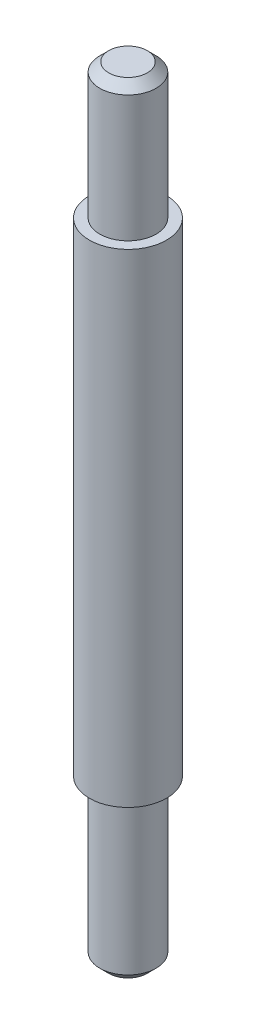
ISO-10303-21;
HEADER;
FILE_DESCRIPTION(('STEP AP214'),'2;1');
FILE_NAME('part.step','',(''),(''),'','','');
FILE_SCHEMA(('AUTOMOTIVE_DESIGN { 1 0 10303 214 1 1 1 1 }'));
ENDSEC;
DATA;
#1=APPLICATION_CONTEXT('core data for automotive mechanical design processes');
#2=APPLICATION_PROTOCOL_DEFINITION('international standard','automotive_design',2000,#1);
#3=PRODUCT_CONTEXT('',#1,'mechanical');
#4=PRODUCT('Part','Part','',(#3));
#5=PRODUCT_RELATED_PRODUCT_CATEGORY('part','',(#4));
#6=PRODUCT_DEFINITION_FORMATION('','',#4);
#7=PRODUCT_DEFINITION_CONTEXT('part definition',#1,'design');
#8=PRODUCT_DEFINITION('design','',#6,#7);
#9=PRODUCT_DEFINITION_SHAPE('','',#8);
#10=(LENGTH_UNIT() NAMED_UNIT(*) SI_UNIT(.MILLI.,.METRE.));
#11=(NAMED_UNIT(*) PLANE_ANGLE_UNIT() SI_UNIT($,.RADIAN.));
#12=(NAMED_UNIT(*) SI_UNIT($,.STERADIAN.) SOLID_ANGLE_UNIT());
#13=UNCERTAINTY_MEASURE_WITH_UNIT(LENGTH_MEASURE(1.E-05),#10,'distance_accuracy_value','');
#14=(GEOMETRIC_REPRESENTATION_CONTEXT(3) GLOBAL_UNCERTAINTY_ASSIGNED_CONTEXT((#13)) GLOBAL_UNIT_ASSIGNED_CONTEXT((#10,
#11,#12)) REPRESENTATION_CONTEXT('',''));
#15=CARTESIAN_POINT('',(0.,0.,0.));
#16=DIRECTION('',(0.,0.,1.));
#17=DIRECTION('',(1.,0.,0.));
#18=AXIS2_PLACEMENT_3D('',#15,#16,#17);
#19=CARTESIAN_POINT('',(0.,127.107886557542,0.));
#20=DIRECTION('',(0.,-1.,0.));
#21=DIRECTION('',(0.,0.,-1.));
#22=AXIS2_PLACEMENT_3D('',#19,#20,#21);
#23=PLANE('',#22);
#24=CARTESIAN_POINT('',(0.,127.107886557542,0.));
#25=DIRECTION('',(0.,1.,0.));
#26=DIRECTION('',(0.,0.,1.));
#27=AXIS2_PLACEMENT_3D('',#24,#25,#26);
#28=CIRCLE('',#27,6.5);
#29=CARTESIAN_POINT('',(0.,127.107886557542,6.5));
#30=VERTEX_POINT('',#29);
#31=EDGE_CURVE('E10',#30,#30,#28,.T.);
#32=ORIENTED_EDGE('',*,*,#31,.T.);
#33=EDGE_LOOP('',(#32));
#34=FACE_BOUND('',#33,.T.);
#35=ADVANCED_FACE('F39',(#34),#23,.F.);
#36=CARTESIAN_POINT('',(0.,124.107886557542,0.));
#37=DIRECTION('',(0.,-1.,0.));
#38=DIRECTION('',(0.,0.,-1.));
#39=AXIS2_PLACEMENT_3D('',#36,#37,#38);
#40=CONICAL_SURFACE('',#39,9.5,0.78539816339745);
#41=ORIENTED_EDGE('',*,*,#31,.F.);
#42=EDGE_LOOP('',(#41));
#43=FACE_BOUND('',#42,.T.);
#44=CARTESIAN_POINT('',(0.,124.107886557542,0.));
#45=DIRECTION('',(0.,1.,0.));
#46=DIRECTION('',(0.,0.,1.));
#47=AXIS2_PLACEMENT_3D('',#44,#45,#46);
#48=CIRCLE('',#47,9.5);
#49=CARTESIAN_POINT('',(0.,124.107886557542,9.5));
#50=VERTEX_POINT('',#49);
#51=EDGE_CURVE('E45',#50,#50,#48,.T.);
#52=ORIENTED_EDGE('',*,*,#51,.T.);
#53=EDGE_LOOP('',(#52));
#54=FACE_BOUND('',#53,.T.);
#55=ADVANCED_FACE('F83',(#43,#54),#40,.T.);
#56=CARTESIAN_POINT('',(0.,127.107886557542,0.));
#57=DIRECTION('',(0.,1.,0.));
#58=DIRECTION('',(0.,0.,1.));
#59=AXIS2_PLACEMENT_3D('',#56,#57,#58);
#60=CYLINDRICAL_SURFACE('',#59,9.50000000000001);
#61=ORIENTED_EDGE('',*,*,#51,.F.);
#62=EDGE_LOOP('',(#61));
#63=FACE_BOUND('',#62,.T.);
#64=CARTESIAN_POINT('',(0.,81.5,0.));
#65=DIRECTION('',(0.,1.,0.));
#66=DIRECTION('',(0.,0.,1.));
#67=AXIS2_PLACEMENT_3D('',#64,#65,#66);
#68=CIRCLE('',#67,9.50000000000003);
#69=CARTESIAN_POINT('',(0.,81.5,9.50000000000003));
#70=VERTEX_POINT('',#69);
#71=EDGE_CURVE('E49',#70,#70,#68,.T.);
#72=ORIENTED_EDGE('',*,*,#71,.T.);
#73=EDGE_LOOP('',(#72));
#74=FACE_BOUND('',#73,.T.);
#75=ADVANCED_FACE('F87',(#63,#74),#60,.T.);
#76=CARTESIAN_POINT('',(9.50000000000003,81.5,0.));
#77=DIRECTION('',(0.,-1.,0.));
#78=DIRECTION('',(0.,0.,-1.));
#79=AXIS2_PLACEMENT_3D('',#76,#77,#78);
#80=PLANE('',#79);
#81=ORIENTED_EDGE('',*,*,#71,.F.);
#82=EDGE_LOOP('',(#81));
#83=FACE_BOUND('',#82,.T.);
#84=CARTESIAN_POINT('',(0.,81.5,0.));
#85=DIRECTION('',(0.,1.,0.));
#86=DIRECTION('',(0.,0.,1.));
#87=AXIS2_PLACEMENT_3D('',#84,#85,#86);
#88=CIRCLE('',#87,13.);
#89=CARTESIAN_POINT('',(0.,81.5,13.));
#90=VERTEX_POINT('',#89);
#91=EDGE_CURVE('E53',#90,#90,#88,.T.);
#92=ORIENTED_EDGE('',*,*,#91,.T.);
#93=EDGE_LOOP('',(#92));
#94=FACE_BOUND('',#93,.T.);
#95=ADVANCED_FACE('F92',(#83,#94),#80,.F.);
#96=CARTESIAN_POINT('',(0.,127.107886557542,0.));
#97=DIRECTION('',(0.,1.,0.));
#98=DIRECTION('',(0.,0.,1.));
#99=AXIS2_PLACEMENT_3D('',#96,#97,#98);
#100=CYLINDRICAL_SURFACE('',#99,13.);
#101=ORIENTED_EDGE('',*,*,#91,.F.);
#102=EDGE_LOOP('',(#101));
#103=FACE_BOUND('',#102,.T.);
#104=CARTESIAN_POINT('',(0.,-81.5,0.));
#105=DIRECTION('',(0.,1.,0.));
#106=DIRECTION('',(0.,0.,1.));
#107=AXIS2_PLACEMENT_3D('',#104,#105,#106);
#108=CIRCLE('',#107,13.);
#109=CARTESIAN_POINT('',(0.,-81.5,13.));
#110=VERTEX_POINT('',#109);
#111=EDGE_CURVE('E58',#110,#110,#108,.T.);
#112=ORIENTED_EDGE('',*,*,#111,.T.);
#113=EDGE_LOOP('',(#112));
#114=FACE_BOUND('',#113,.T.);
#115=ADVANCED_FACE('F98',(#103,#114),#100,.T.);
#116=CARTESIAN_POINT('',(13.,-81.5,0.));
#117=DIRECTION('',(0.,1.,0.));
#118=DIRECTION('',(0.,0.,1.));
#119=AXIS2_PLACEMENT_3D('',#116,#117,#118);
#120=PLANE('',#119);
#121=ORIENTED_EDGE('',*,*,#111,.F.);
#122=EDGE_LOOP('',(#121));
#123=FACE_BOUND('',#122,.T.);
#124=CARTESIAN_POINT('',(0.,-81.5,0.));
#125=DIRECTION('',(0.,1.,0.));
#126=DIRECTION('',(0.,0.,1.));
#127=AXIS2_PLACEMENT_3D('',#124,#125,#126);
#128=CIRCLE('',#127,9.50000000000003);
#129=CARTESIAN_POINT('',(0.,-81.5,9.50000000000003));
#130=VERTEX_POINT('',#129);
#131=EDGE_CURVE('E61',#130,#130,#128,.T.);
#132=ORIENTED_EDGE('',*,*,#131,.T.);
#133=EDGE_LOOP('',(#132));
#134=FACE_BOUND('',#133,.T.);
#135=ADVANCED_FACE('F102',(#123,#134),#120,.F.);
#136=CARTESIAN_POINT('',(0.,127.107886557542,0.));
#137=DIRECTION('',(0.,1.,0.));
#138=DIRECTION('',(0.,0.,1.));
#139=AXIS2_PLACEMENT_3D('',#136,#137,#138);
#140=CYLINDRICAL_SURFACE('',#139,9.50000000000003);
#141=ORIENTED_EDGE('',*,*,#131,.F.);
#142=EDGE_LOOP('',(#141));
#143=FACE_BOUND('',#142,.T.);
#144=CARTESIAN_POINT('',(0.,-132.892113442458,0.));
#145=DIRECTION('',(0.,1.,0.));
#146=DIRECTION('',(0.,0.,1.));
#147=AXIS2_PLACEMENT_3D('',#144,#145,#146);
#148=CIRCLE('',#147,9.50000000000003);
#149=CARTESIAN_POINT('',(0.,-132.892113442458,9.50000000000003));
#150=VERTEX_POINT('',#149);
#151=EDGE_CURVE('E64',#150,#150,#148,.T.);
#152=ORIENTED_EDGE('',*,*,#151,.T.);
#153=EDGE_LOOP('',(#152));
#154=FACE_BOUND('',#153,.T.);
#155=ADVANCED_FACE('F79',(#143,#154),#140,.T.);
#156=CARTESIAN_POINT('',(0.,-135.892113442458,0.));
#157=DIRECTION('',(0.,1.,0.));
#158=DIRECTION('',(0.,0.,1.));
#159=AXIS2_PLACEMENT_3D('',#156,#157,#158);
#160=CONICAL_SURFACE('',#159,6.50000000000004,0.785398163397446);
#161=ORIENTED_EDGE('',*,*,#151,.F.);
#162=EDGE_LOOP('',(#161));
#163=FACE_BOUND('',#162,.T.);
#164=CARTESIAN_POINT('',(0.,-135.892113442458,0.));
#165=DIRECTION('',(0.,1.,0.));
#166=DIRECTION('',(0.,0.,1.));
#167=AXIS2_PLACEMENT_3D('',#164,#165,#166);
#168=CIRCLE('',#167,6.50000000000004);
#169=CARTESIAN_POINT('',(0.,-135.892113442458,6.50000000000004));
#170=VERTEX_POINT('',#169);
#171=EDGE_CURVE('E67',#170,#170,#168,.T.);
#172=ORIENTED_EDGE('',*,*,#171,.T.);
#173=EDGE_LOOP('',(#172));
#174=FACE_BOUND('',#173,.T.);
#175=ADVANCED_FACE('F71',(#163,#174),#160,.T.);
#176=CARTESIAN_POINT('',(6.50000000000004,-135.892113442458,0.));
#177=DIRECTION('',(0.,1.,0.));
#178=DIRECTION('',(0.,0.,1.));
#179=AXIS2_PLACEMENT_3D('',#176,#177,#178);
#180=PLANE('',#179);
#181=ORIENTED_EDGE('',*,*,#171,.F.);
#182=EDGE_LOOP('',(#181));
#183=FACE_BOUND('',#182,.T.);
#184=ADVANCED_FACE('F73',(#183),#180,.F.);
#185=CLOSED_SHELL('',(#35,#55,#75,#95,#115,#135,#155,#175,#184));
#186=MANIFOLD_SOLID_BREP('B2',#185);
#187=ADVANCED_BREP_SHAPE_REPRESENTATION('',(#18,#186),#14);
#188=SHAPE_DEFINITION_REPRESENTATION(#9,#187);
ENDSEC;
END-ISO-10303-21;
